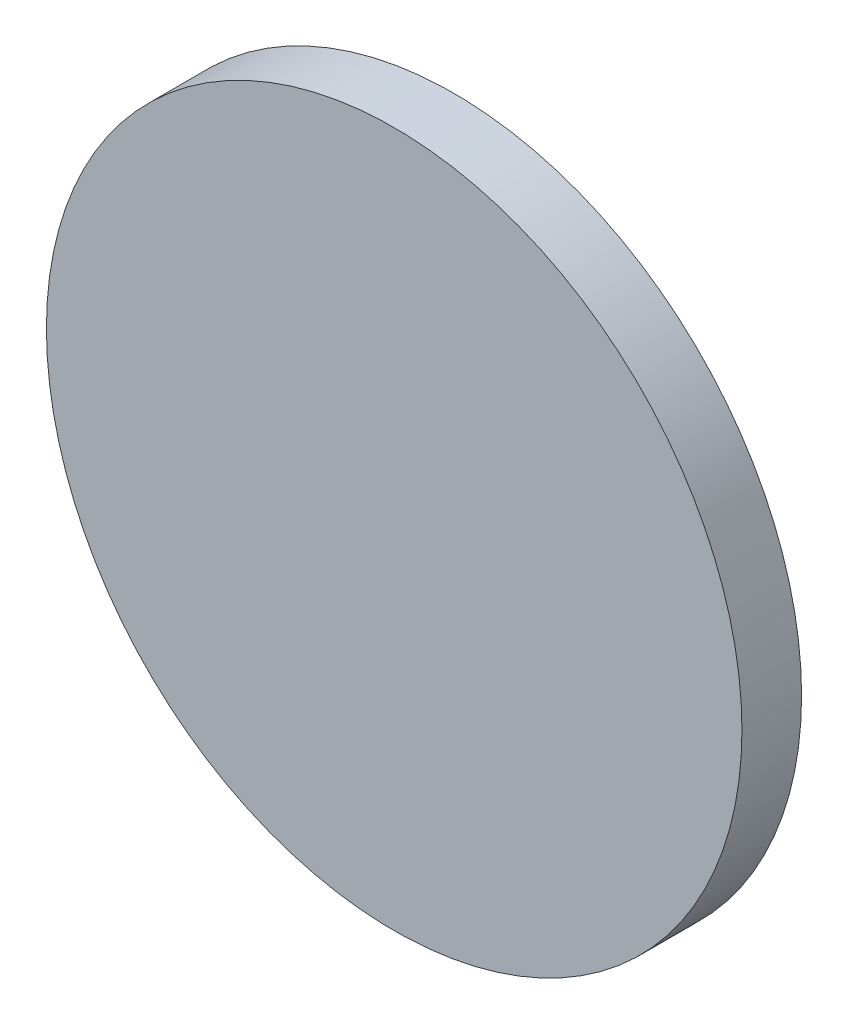
ISO-10303-21;
HEADER;
FILE_DESCRIPTION(('STEP AP214'),'2;1');
FILE_NAME('part.step','',(''),(''),'','','');
FILE_SCHEMA(('AUTOMOTIVE_DESIGN { 1 0 10303 214 1 1 1 1 }'));
ENDSEC;
DATA;
#1=APPLICATION_CONTEXT('core data for automotive mechanical design processes');
#2=APPLICATION_PROTOCOL_DEFINITION('international standard','automotive_design',2000,#1);
#3=PRODUCT_CONTEXT('',#1,'mechanical');
#4=PRODUCT('Part','Part','',(#3));
#5=PRODUCT_RELATED_PRODUCT_CATEGORY('part','',(#4));
#6=PRODUCT_DEFINITION_FORMATION('','',#4);
#7=PRODUCT_DEFINITION_CONTEXT('part definition',#1,'design');
#8=PRODUCT_DEFINITION('design','',#6,#7);
#9=PRODUCT_DEFINITION_SHAPE('','',#8);
#10=(LENGTH_UNIT() NAMED_UNIT(*) SI_UNIT(.MILLI.,.METRE.));
#11=(NAMED_UNIT(*) PLANE_ANGLE_UNIT() SI_UNIT($,.RADIAN.));
#12=(NAMED_UNIT(*) SI_UNIT($,.STERADIAN.) SOLID_ANGLE_UNIT());
#13=UNCERTAINTY_MEASURE_WITH_UNIT(LENGTH_MEASURE(1.E-05),#10,'distance_accuracy_value','');
#14=(GEOMETRIC_REPRESENTATION_CONTEXT(3) GLOBAL_UNCERTAINTY_ASSIGNED_CONTEXT((#13)) GLOBAL_UNIT_ASSIGNED_CONTEXT((#10,
#11,#12)) REPRESENTATION_CONTEXT('',''));
#15=CARTESIAN_POINT('',(0.,0.,0.));
#16=DIRECTION('',(0.,0.,1.));
#17=DIRECTION('',(1.,0.,0.));
#18=AXIS2_PLACEMENT_3D('',#15,#16,#17);
#19=CARTESIAN_POINT('',(6.98208,9.85,0.79916));
#20=DIRECTION('',(0.,0.,1.));
#21=DIRECTION('',(1.,0.,0.));
#22=AXIS2_PLACEMENT_3D('',#19,#20,#21);
#23=PLANE('',#22);
#24=CARTESIAN_POINT('',(6.98208,9.85,0.79916));
#25=DIRECTION('',(0.,0.,1.));
#26=DIRECTION('',(1.,0.,0.));
#27=AXIS2_PLACEMENT_3D('',#24,#25,#26);
#28=CIRCLE('',#27,0.200024667);
#29=CARTESIAN_POINT('',(7.182104667,9.85,0.79916));
#30=VERTEX_POINT('',#29);
#31=EDGE_CURVE('E18',#30,#30,#28,.F.);
#32=ORIENTED_EDGE('',*,*,#31,.F.);
#33=EDGE_LOOP('',(#32));
#34=FACE_BOUND('',#33,.T.);
#35=ADVANCED_FACE('F15',(#34),#23,.T.);
#36=CARTESIAN_POINT('',(6.98208,9.85,0.76487));
#37=DIRECTION('',(0.,0.,1.));
#38=DIRECTION('',(1.,0.,0.));
#39=AXIS2_PLACEMENT_3D('',#36,#37,#38);
#40=CYLINDRICAL_SURFACE('',#39,0.200024667);
#41=ORIENTED_EDGE('',*,*,#31,.T.);
#42=EDGE_LOOP('',(#41));
#43=FACE_BOUND('',#42,.T.);
#44=CARTESIAN_POINT('',(6.98208,9.85,0.76487));
#45=DIRECTION('',(0.,0.,1.));
#46=DIRECTION('',(1.,0.,0.));
#47=AXIS2_PLACEMENT_3D('',#44,#45,#46);
#48=CIRCLE('',#47,0.200024667);
#49=CARTESIAN_POINT('',(7.182104667,9.85,0.76487));
#50=VERTEX_POINT('',#49);
#51=EDGE_CURVE('E10',#50,#50,#48,.F.);
#52=ORIENTED_EDGE('',*,*,#51,.F.);
#53=EDGE_LOOP('',(#52));
#54=FACE_BOUND('',#53,.T.);
#55=ADVANCED_FACE('F27',(#43,#54),#40,.T.);
#56=CARTESIAN_POINT('',(6.98208,9.85,0.76487));
#57=DIRECTION('',(0.,0.,-1.));
#58=DIRECTION('',(-1.,0.,0.));
#59=AXIS2_PLACEMENT_3D('',#56,#57,#58);
#60=PLANE('',#59);
#61=ORIENTED_EDGE('',*,*,#51,.T.);
#62=EDGE_LOOP('',(#61));
#63=FACE_BOUND('',#62,.T.);
#64=ADVANCED_FACE('F35',(#63),#60,.T.);
#65=CLOSED_SHELL('',(#35,#55,#64));
#66=MANIFOLD_SOLID_BREP('B1',#65);
#67=ADVANCED_BREP_SHAPE_REPRESENTATION('',(#18,#66),#14);
#68=SHAPE_DEFINITION_REPRESENTATION(#9,#67);
ENDSEC;
END-ISO-10303-21;
